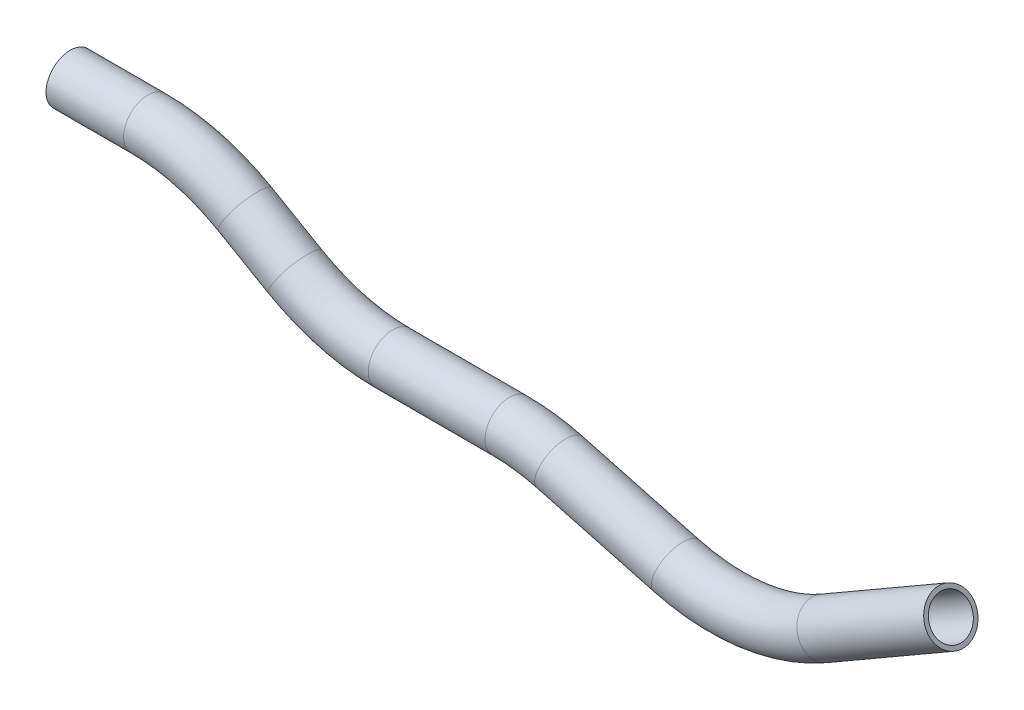
ISO-10303-21;
HEADER;
FILE_DESCRIPTION(('STEP AP214'),'2;1');
FILE_NAME('part.step','',(''),(''),'','','');
FILE_SCHEMA(('AUTOMOTIVE_DESIGN { 1 0 10303 214 1 1 1 1 }'));
ENDSEC;
DATA;
#1=APPLICATION_CONTEXT('core data for automotive mechanical design processes');
#2=APPLICATION_PROTOCOL_DEFINITION('international standard','automotive_design',2000,#1);
#3=PRODUCT_CONTEXT('',#1,'mechanical');
#4=PRODUCT('Part','Part','',(#3));
#5=PRODUCT_RELATED_PRODUCT_CATEGORY('part','',(#4));
#6=PRODUCT_DEFINITION_FORMATION('','',#4);
#7=PRODUCT_DEFINITION_CONTEXT('part definition',#1,'design');
#8=PRODUCT_DEFINITION('design','',#6,#7);
#9=PRODUCT_DEFINITION_SHAPE('','',#8);
#10=(LENGTH_UNIT() NAMED_UNIT(*) SI_UNIT(.MILLI.,.METRE.));
#11=(NAMED_UNIT(*) PLANE_ANGLE_UNIT() SI_UNIT($,.RADIAN.));
#12=(NAMED_UNIT(*) SI_UNIT($,.STERADIAN.) SOLID_ANGLE_UNIT());
#13=UNCERTAINTY_MEASURE_WITH_UNIT(LENGTH_MEASURE(1.E-05),#10,'distance_accuracy_value','');
#14=(GEOMETRIC_REPRESENTATION_CONTEXT(3) GLOBAL_UNCERTAINTY_ASSIGNED_CONTEXT((#13)) GLOBAL_UNIT_ASSIGNED_CONTEXT((#10,
#11,#12)) REPRESENTATION_CONTEXT('',''));
#15=CARTESIAN_POINT('',(0.,0.,0.));
#16=DIRECTION('',(0.,0.,1.));
#17=DIRECTION('',(1.,0.,0.));
#18=AXIS2_PLACEMENT_3D('',#15,#16,#17);
#19=CARTESIAN_POINT('',(-53.3146424442584,60.8356250725051,0.));
#20=DIRECTION('',(1.,0.,0.));
#21=DIRECTION('',(0.,1.,0.));
#22=AXIS2_PLACEMENT_3D('',#19,#20,#21);
#23=CYLINDRICAL_SURFACE('',#22,9.525);
#24=CARTESIAN_POINT('',(-22.93237090751,60.8356250725051,0.));
#25=DIRECTION('',(1.,0.,0.));
#26=DIRECTION('',(0.,1.,0.));
#27=AXIS2_PLACEMENT_3D('',#24,#25,#26);
#28=CIRCLE('',#27,9.525);
#29=CARTESIAN_POINT('',(-22.93237090751,70.3606250725051,0.));
#30=VERTEX_POINT('',#29);
#31=EDGE_CURVE('E58',#30,#30,#28,.T.);
#32=ORIENTED_EDGE('',*,*,#31,.F.);
#33=EDGE_LOOP('',(#32));
#34=FACE_BOUND('',#33,.T.);
#35=CARTESIAN_POINT('',(-53.3146424442584,60.8356250725051,0.));
#36=DIRECTION('',(1.,0.,0.));
#37=DIRECTION('',(0.,1.,0.));
#38=AXIS2_PLACEMENT_3D('',#35,#36,#37);
#39=CIRCLE('',#38,9.525);
#40=CARTESIAN_POINT('',(-53.3146424442584,70.3606250725051,0.));
#41=VERTEX_POINT('',#40);
#42=EDGE_CURVE('E55',#41,#41,#39,.T.);
#43=ORIENTED_EDGE('',*,*,#42,.T.);
#44=EDGE_LOOP('',(#43));
#45=FACE_BOUND('',#44,.T.);
#46=ADVANCED_FACE('F34',(#34,#45),#23,.T.);
#47=CARTESIAN_POINT('',(-22.93237090751,-15.3643749274949,0.));
#48=DIRECTION('',(0.,0.,-1.));
#49=DIRECTION('',(-1.,0.,0.));
#50=AXIS2_PLACEMENT_3D('',#47,#48,#49);
#51=TOROIDAL_SURFACE('',#50,76.2,9.525);
#52=CARTESIAN_POINT('',(15.1676290924901,50.6267608408792,0.));
#53=DIRECTION('',(0.866025403784438,-0.500000000000001,0.));
#54=DIRECTION('',(0.500000000000001,0.866025403784438,0.));
#55=AXIS2_PLACEMENT_3D('',#52,#53,#54);
#56=CIRCLE('',#55,9.525);
#57=CARTESIAN_POINT('',(19.9301290924901,58.8756528119261,0.));
#58=VERTEX_POINT('',#57);
#59=EDGE_CURVE('E61',#58,#58,#56,.T.);
#60=CARTESIAN_POINT('',(-22.93237090751,-15.3643749274949,0.));
#61=DIRECTION('',(0.,0.,-1.));
#62=DIRECTION('',(-1.,0.,0.));
#63=AXIS2_PLACEMENT_3D('',#60,#61,#62);
#64=CIRCLE('',#63,85.725);
#65=EDGE_CURVE('',#30,#58,#64,.T.);
#66=ORIENTED_EDGE('',*,*,#31,.T.);
#67=ORIENTED_EDGE('',*,*,#59,.F.);
#68=ORIENTED_EDGE('',*,*,#65,.T.);
#69=ORIENTED_EDGE('',*,*,#65,.F.);
#70=EDGE_LOOP('',(#66,#68,#67,#69));
#71=FACE_BOUND('',#70,.T.);
#72=ADVANCED_FACE('F118',(#71),#51,.T.);
#73=CARTESIAN_POINT('',(15.1676290924901,50.6267608408793,0.));
#74=DIRECTION('',(0.866025403784438,-0.5,0.));
#75=DIRECTION('',(0.5,0.866025403784438,0.));
#76=AXIS2_PLACEMENT_3D('',#73,#74,#75);
#77=CYLINDRICAL_SURFACE('',#76,9.525);
#78=CARTESIAN_POINT('',(34.7956991593049,39.2944893041309,0.));
#79=DIRECTION('',(0.866025403784439,-0.5,0.));
#80=DIRECTION('',(0.5,0.866025403784439,0.));
#81=AXIS2_PLACEMENT_3D('',#78,#79,#80);
#82=CIRCLE('',#81,9.525);
#83=CARTESIAN_POINT('',(30.0331991593048,31.0455973330841,0.));
#84=VERTEX_POINT('',#83);
#85=EDGE_CURVE('E64',#84,#84,#82,.T.);
#86=ORIENTED_EDGE('',*,*,#85,.F.);
#87=EDGE_LOOP('',(#86));
#88=FACE_BOUND('',#87,.T.);
#89=ORIENTED_EDGE('',*,*,#59,.T.);
#90=EDGE_LOOP('',(#89));
#91=FACE_BOUND('',#90,.T.);
#92=ADVANCED_FACE('F122',(#88,#91),#77,.T.);
#93=CARTESIAN_POINT('',(72.8956991593049,105.285625072505,0.));
#94=DIRECTION('',(0.,0.,1.));
#95=DIRECTION('',(1.,0.,0.));
#96=AXIS2_PLACEMENT_3D('',#93,#94,#95);
#97=TOROIDAL_SURFACE('',#96,76.2,9.525);
#98=CARTESIAN_POINT('',(72.8956991593051,29.0856250725052,0.));
#99=DIRECTION('',(1.,0.,0.));
#100=DIRECTION('',(0.,1.,0.));
#101=AXIS2_PLACEMENT_3D('',#98,#99,#100);
#102=CIRCLE('',#101,9.525);
#103=CARTESIAN_POINT('',(72.8956991593051,19.5606250725051,0.));
#104=VERTEX_POINT('',#103);
#105=EDGE_CURVE('E67',#104,#104,#102,.T.);
#106=CARTESIAN_POINT('',(72.8956991593049,105.285625072505,0.));
#107=DIRECTION('',(0.,0.,1.));
#108=DIRECTION('',(1.,0.,0.));
#109=AXIS2_PLACEMENT_3D('',#106,#107,#108);
#110=CIRCLE('',#109,85.725);
#111=EDGE_CURVE('',#84,#104,#110,.T.);
#112=ORIENTED_EDGE('',*,*,#85,.T.);
#113=ORIENTED_EDGE('',*,*,#105,.F.);
#114=ORIENTED_EDGE('',*,*,#111,.T.);
#115=ORIENTED_EDGE('',*,*,#111,.F.);
#116=EDGE_LOOP('',(#112,#114,#113,#115));
#117=FACE_BOUND('',#116,.T.);
#118=ADVANCED_FACE('F126',(#117),#97,.T.);
#119=CARTESIAN_POINT('',(72.8956991593051,29.0856250725052,0.));
#120=DIRECTION('',(1.,0.,0.));
#121=DIRECTION('',(0.,1.,0.));
#122=AXIS2_PLACEMENT_3D('',#119,#120,#121);
#123=CYLINDRICAL_SURFACE('',#122,9.525);
#124=CARTESIAN_POINT('',(118.646050379894,29.0856250725052,0.));
#125=DIRECTION('',(1.,0.,0.));
#126=DIRECTION('',(0.,1.,0.));
#127=AXIS2_PLACEMENT_3D('',#124,#125,#126);
#128=CIRCLE('',#127,9.525);
#129=CARTESIAN_POINT('',(118.646050379894,38.6106250725052,0.));
#130=VERTEX_POINT('',#129);
#131=EDGE_CURVE('E70',#130,#130,#128,.T.);
#132=ORIENTED_EDGE('',*,*,#131,.F.);
#133=EDGE_LOOP('',(#132));
#134=FACE_BOUND('',#133,.T.);
#135=ORIENTED_EDGE('',*,*,#105,.T.);
#136=EDGE_LOOP('',(#135));
#137=FACE_BOUND('',#136,.T.);
#138=ADVANCED_FACE('F130',(#134,#137),#123,.T.);
#139=CARTESIAN_POINT('',(118.646050379894,-47.1143749274949,0.));
#140=DIRECTION('',(0.,0.,-1.));
#141=DIRECTION('',(-1.,0.,0.));
#142=AXIS2_PLACEMENT_3D('',#139,#140,#141);
#143=TOROIDAL_SURFACE('',#142,76.2000000000001,9.525);
#144=CARTESIAN_POINT('',(138.368061616706,26.4891730357321,0.));
#145=DIRECTION('',(0.965925826289069,-0.25881904510252,0.));
#146=DIRECTION('',(0.25881904510252,0.965925826289069,0.));
#147=AXIS2_PLACEMENT_3D('',#144,#145,#146);
#148=CIRCLE('',#147,9.525);
#149=CARTESIAN_POINT('',(140.833313021308,35.6896165311356,0.));
#150=VERTEX_POINT('',#149);
#151=EDGE_CURVE('E73',#150,#150,#148,.T.);
#152=CARTESIAN_POINT('',(118.646050379894,-47.1143749274949,0.));
#153=DIRECTION('',(0.,0.,-1.));
#154=DIRECTION('',(-1.,0.,0.));
#155=AXIS2_PLACEMENT_3D('',#152,#153,#154);
#156=CIRCLE('',#155,85.7250000000001);
#157=EDGE_CURVE('',#130,#150,#156,.T.);
#158=ORIENTED_EDGE('',*,*,#131,.T.);
#159=ORIENTED_EDGE('',*,*,#151,.F.);
#160=ORIENTED_EDGE('',*,*,#157,.T.);
#161=ORIENTED_EDGE('',*,*,#157,.F.);
#162=EDGE_LOOP('',(#158,#160,#159,#161));
#163=FACE_BOUND('',#162,.T.);
#164=ADVANCED_FACE('F92',(#163),#143,.T.);
#165=CARTESIAN_POINT('',(138.368061616706,26.4891730357321,0.));
#166=DIRECTION('',(0.965925826289068,-0.258819045102521,0.));
#167=DIRECTION('',(0.258819045102521,0.965925826289068,0.));
#168=AXIS2_PLACEMENT_3D('',#165,#166,#167);
#169=CYLINDRICAL_SURFACE('',#168,9.525);
#170=CARTESIAN_POINT('',(184.061188848004,14.2457364944532,0.));
#171=DIRECTION('',(0.965925826289068,-0.258819045102521,0.));
#172=DIRECTION('',(0.258819045102521,0.965925826289068,0.));
#173=AXIS2_PLACEMENT_3D('',#170,#171,#172);
#174=CIRCLE('',#173,9.525);
#175=CARTESIAN_POINT('',(181.595937443403,5.04529299904981,0.));
#176=VERTEX_POINT('',#175);
#177=EDGE_CURVE('E75',#176,#176,#174,.T.);
#178=ORIENTED_EDGE('',*,*,#177,.F.);
#179=EDGE_LOOP('',(#178));
#180=FACE_BOUND('',#179,.T.);
#181=ORIENTED_EDGE('',*,*,#151,.T.);
#182=EDGE_LOOP('',(#181));
#183=FACE_BOUND('',#182,.T.);
#184=ADVANCED_FACE('F85',(#180,#183),#169,.T.);
#185=CARTESIAN_POINT('',(203.783200084816,87.8492844576802,0.));
#186=DIRECTION('',(0.,0.,1.));
#187=DIRECTION('',(1.,0.,0.));
#188=AXIS2_PLACEMENT_3D('',#185,#186,#187);
#189=TOROIDAL_SURFACE('',#188,76.2,9.525);
#190=CARTESIAN_POINT('',(241.883200084816,21.858148689306,0.));
#191=DIRECTION('',(0.866025403784438,0.500000000000001,0.));
#192=DIRECTION('',(-0.500000000000001,0.866025403784438,0.));
#193=AXIS2_PLACEMENT_3D('',#190,#191,#192);
#194=CIRCLE('',#193,9.525);
#195=CARTESIAN_POINT('',(246.645700084816,13.6092567182592,0.));
#196=VERTEX_POINT('',#195);
#197=EDGE_CURVE('E38',#196,#196,#194,.T.);
#198=CARTESIAN_POINT('',(203.783200084816,87.8492844576802,0.));
#199=DIRECTION('',(0.,0.,1.));
#200=DIRECTION('',(1.,0.,0.));
#201=AXIS2_PLACEMENT_3D('',#198,#199,#200);
#202=CIRCLE('',#201,85.725);
#203=EDGE_CURVE('',#176,#196,#202,.T.);
#204=ORIENTED_EDGE('',*,*,#177,.T.);
#205=ORIENTED_EDGE('',*,*,#197,.F.);
#206=ORIENTED_EDGE('',*,*,#203,.T.);
#207=ORIENTED_EDGE('',*,*,#203,.F.);
#208=EDGE_LOOP('',(#204,#206,#205,#207));
#209=FACE_BOUND('',#208,.T.);
#210=ADVANCED_FACE('F83',(#209),#189,.T.);
#211=CARTESIAN_POINT('',(241.883200084817,21.858148689306,0.));
#212=DIRECTION('',(0.866025403784437,0.500000000000003,0.));
#213=DIRECTION('',(-0.500000000000003,0.866025403784437,0.));
#214=AXIS2_PLACEMENT_3D('',#211,#212,#213);
#215=CYLINDRICAL_SURFACE('',#214,9.525);
#216=CARTESIAN_POINT('',(291.538435049588,50.5266119628912,0.));
#217=DIRECTION('',(0.866025403784437,0.500000000000003,0.));
#218=DIRECTION('',(-0.500000000000003,0.866025403784437,0.));
#219=AXIS2_PLACEMENT_3D('',#216,#217,#218);
#220=CIRCLE('',#219,9.525);
#221=CARTESIAN_POINT('',(286.775935049588,58.775503933938,0.));
#222=VERTEX_POINT('',#221);
#223=EDGE_CURVE('E51',#222,#222,#220,.T.);
#224=ORIENTED_EDGE('',*,*,#223,.F.);
#225=EDGE_LOOP('',(#224));
#226=FACE_BOUND('',#225,.T.);
#227=ORIENTED_EDGE('',*,*,#197,.T.);
#228=EDGE_LOOP('',(#227));
#229=FACE_BOUND('',#228,.T.);
#230=ADVANCED_FACE('F36',(#226,#229),#215,.T.);
#231=CARTESIAN_POINT('',(-53.3146424442584,60.8356250725051,0.));
#232=DIRECTION('',(1.,0.,0.));
#233=DIRECTION('',(0.,1.,0.));
#234=AXIS2_PLACEMENT_3D('',#231,#232,#233);
#235=PLANE('',#234);
#236=CARTESIAN_POINT('',(-53.3146424442584,60.8356250725051,0.));
#237=DIRECTION('',(1.,0.,0.));
#238=DIRECTION('',(0.,1.,0.));
#239=AXIS2_PLACEMENT_3D('',#236,#237,#238);
#240=CIRCLE('',#239,7.874);
#241=CARTESIAN_POINT('',(-53.3146424442584,68.7096250725051,0.));
#242=VERTEX_POINT('',#241);
#243=EDGE_CURVE('E54',#242,#242,#240,.F.);
#244=ORIENTED_EDGE('',*,*,#243,.F.);
#245=EDGE_LOOP('',(#244));
#246=FACE_BOUND('',#245,.T.);
#247=ORIENTED_EDGE('',*,*,#42,.F.);
#248=EDGE_LOOP('',(#247));
#249=FACE_BOUND('',#248,.T.);
#250=ADVANCED_FACE('F90',(#246,#249),#235,.F.);
#251=CARTESIAN_POINT('',(291.538435049588,50.5266119628912,0.));
#252=DIRECTION('',(0.866025403784437,0.500000000000003,0.));
#253=DIRECTION('',(-0.500000000000003,0.866025403784437,0.));
#254=AXIS2_PLACEMENT_3D('',#251,#252,#253);
#255=PLANE('',#254);
#256=CARTESIAN_POINT('',(291.538435049588,50.5266119628912,0.));
#257=DIRECTION('',(0.866025403784437,0.500000000000003,0.));
#258=DIRECTION('',(-0.500000000000003,0.866025403784437,0.));
#259=AXIS2_PLACEMENT_3D('',#256,#257,#258);
#260=CIRCLE('',#259,7.874);
#261=CARTESIAN_POINT('',(287.601435049588,57.3456959922899,0.));
#262=VERTEX_POINT('',#261);
#263=EDGE_CURVE('E10',#262,#262,#260,.F.);
#264=ORIENTED_EDGE('',*,*,#263,.T.);
#265=EDGE_LOOP('',(#264));
#266=FACE_BOUND('',#265,.T.);
#267=ORIENTED_EDGE('',*,*,#223,.T.);
#268=EDGE_LOOP('',(#267));
#269=FACE_BOUND('',#268,.T.);
#270=ADVANCED_FACE('F109',(#266,#269),#255,.T.);
#271=CARTESIAN_POINT('',(-53.3146424442584,60.8356250725051,0.));
#272=DIRECTION('',(1.,0.,0.));
#273=DIRECTION('',(0.,1.,0.));
#274=AXIS2_PLACEMENT_3D('',#271,#272,#273);
#275=CYLINDRICAL_SURFACE('',#274,7.874);
#276=CARTESIAN_POINT('',(-22.93237090751,60.8356250725051,0.));
#277=DIRECTION('',(1.,0.,0.));
#278=DIRECTION('',(0.,1.,0.));
#279=AXIS2_PLACEMENT_3D('',#276,#277,#278);
#280=CIRCLE('',#279,7.874);
#281=CARTESIAN_POINT('',(-22.93237090751,68.7096250725051,0.));
#282=VERTEX_POINT('',#281);
#283=EDGE_CURVE('E283',#282,#282,#280,.F.);
#284=ORIENTED_EDGE('',*,*,#283,.F.);
#285=EDGE_LOOP('',(#284));
#286=FACE_BOUND('',#285,.T.);
#287=ORIENTED_EDGE('',*,*,#243,.T.);
#288=EDGE_LOOP('',(#287));
#289=FACE_BOUND('',#288,.T.);
#290=ADVANCED_FACE('F112',(#286,#289),#275,.F.);
#291=CARTESIAN_POINT('',(-22.93237090751,-15.3643749274949,0.));
#292=DIRECTION('',(0.,0.,-1.));
#293=DIRECTION('',(-1.,0.,0.));
#294=AXIS2_PLACEMENT_3D('',#291,#292,#293);
#295=TOROIDAL_SURFACE('',#294,76.2,7.874);
#296=CARTESIAN_POINT('',(15.1676290924901,50.6267608408792,0.));
#297=DIRECTION('',(0.866025403784438,-0.500000000000001,0.));
#298=DIRECTION('',(0.500000000000001,0.866025403784438,0.));
#299=AXIS2_PLACEMENT_3D('',#296,#297,#298);
#300=CIRCLE('',#299,7.874);
#301=CARTESIAN_POINT('',(19.1046290924901,57.4458448702779,0.));
#302=VERTEX_POINT('',#301);
#303=EDGE_CURVE('E280',#302,#302,#300,.F.);
#304=CARTESIAN_POINT('',(-22.93237090751,-15.3643749274949,0.));
#305=DIRECTION('',(0.,0.,-1.));
#306=DIRECTION('',(-1.,0.,0.));
#307=AXIS2_PLACEMENT_3D('',#304,#305,#306);
#308=CIRCLE('',#307,84.074);
#309=EDGE_CURVE('',#282,#302,#308,.T.);
#310=ORIENTED_EDGE('',*,*,#283,.T.);
#311=ORIENTED_EDGE('',*,*,#303,.F.);
#312=ORIENTED_EDGE('',*,*,#309,.T.);
#313=ORIENTED_EDGE('',*,*,#309,.F.);
#314=EDGE_LOOP('',(#310,#312,#311,#313));
#315=FACE_BOUND('',#314,.T.);
#316=ADVANCED_FACE('F191',(#315),#295,.F.);
#317=CARTESIAN_POINT('',(15.1676290924901,50.6267608408793,0.));
#318=DIRECTION('',(0.866025403784438,-0.5,0.));
#319=DIRECTION('',(0.5,0.866025403784438,0.));
#320=AXIS2_PLACEMENT_3D('',#317,#318,#319);
#321=CYLINDRICAL_SURFACE('',#320,7.874);
#322=CARTESIAN_POINT('',(34.7956991593049,39.2944893041309,0.));
#323=DIRECTION('',(0.866025403784439,-0.5,0.));
#324=DIRECTION('',(0.5,0.866025403784439,0.));
#325=AXIS2_PLACEMENT_3D('',#322,#323,#324);
#326=CIRCLE('',#325,7.874);
#327=CARTESIAN_POINT('',(30.8586991593048,32.4754052747322,0.));
#328=VERTEX_POINT('',#327);
#329=EDGE_CURVE('E277',#328,#328,#326,.F.);
#330=ORIENTED_EDGE('',*,*,#329,.F.);
#331=EDGE_LOOP('',(#330));
#332=FACE_BOUND('',#331,.T.);
#333=ORIENTED_EDGE('',*,*,#303,.T.);
#334=EDGE_LOOP('',(#333));
#335=FACE_BOUND('',#334,.T.);
#336=ADVANCED_FACE('F201',(#332,#335),#321,.F.);
#337=CARTESIAN_POINT('',(72.8956991593049,105.285625072505,0.));
#338=DIRECTION('',(0.,0.,1.));
#339=DIRECTION('',(1.,0.,0.));
#340=AXIS2_PLACEMENT_3D('',#337,#338,#339);
#341=TOROIDAL_SURFACE('',#340,76.2,7.874);
#342=CARTESIAN_POINT('',(72.8956991593051,29.0856250725052,0.));
#343=DIRECTION('',(1.,0.,0.));
#344=DIRECTION('',(0.,1.,0.));
#345=AXIS2_PLACEMENT_3D('',#342,#343,#344);
#346=CIRCLE('',#345,7.874);
#347=CARTESIAN_POINT('',(72.8956991593051,21.2116250725051,0.));
#348=VERTEX_POINT('',#347);
#349=EDGE_CURVE('E272',#348,#348,#346,.F.);
#350=CARTESIAN_POINT('',(72.8956991593049,105.285625072505,0.));
#351=DIRECTION('',(0.,0.,1.));
#352=DIRECTION('',(1.,0.,0.));
#353=AXIS2_PLACEMENT_3D('',#350,#351,#352);
#354=CIRCLE('',#353,84.074);
#355=EDGE_CURVE('',#328,#348,#354,.T.);
#356=ORIENTED_EDGE('',*,*,#329,.T.);
#357=ORIENTED_EDGE('',*,*,#349,.F.);
#358=ORIENTED_EDGE('',*,*,#355,.T.);
#359=ORIENTED_EDGE('',*,*,#355,.F.);
#360=EDGE_LOOP('',(#356,#358,#357,#359));
#361=FACE_BOUND('',#360,.T.);
#362=ADVANCED_FACE('F211',(#361),#341,.F.);
#363=CARTESIAN_POINT('',(72.8956991593051,29.0856250725052,0.));
#364=DIRECTION('',(1.,0.,0.));
#365=DIRECTION('',(0.,1.,0.));
#366=AXIS2_PLACEMENT_3D('',#363,#364,#365);
#367=CYLINDRICAL_SURFACE('',#366,7.874);
#368=CARTESIAN_POINT('',(118.646050379894,29.0856250725052,0.));
#369=DIRECTION('',(1.,0.,0.));
#370=DIRECTION('',(0.,1.,0.));
#371=AXIS2_PLACEMENT_3D('',#368,#369,#370);
#372=CIRCLE('',#371,7.874);
#373=CARTESIAN_POINT('',(118.646050379894,36.9596250725052,0.));
#374=VERTEX_POINT('',#373);
#375=EDGE_CURVE('E269',#374,#374,#372,.F.);
#376=ORIENTED_EDGE('',*,*,#375,.F.);
#377=EDGE_LOOP('',(#376));
#378=FACE_BOUND('',#377,.T.);
#379=ORIENTED_EDGE('',*,*,#349,.T.);
#380=EDGE_LOOP('',(#379));
#381=FACE_BOUND('',#380,.T.);
#382=ADVANCED_FACE('F221',(#378,#381),#367,.F.);
#383=CARTESIAN_POINT('',(118.646050379894,-47.1143749274949,0.));
#384=DIRECTION('',(0.,0.,-1.));
#385=DIRECTION('',(-1.,0.,0.));
#386=AXIS2_PLACEMENT_3D('',#383,#384,#385);
#387=TOROIDAL_SURFACE('',#386,76.2000000000001,7.874);
#388=CARTESIAN_POINT('',(138.368061616706,26.4891730357321,0.));
#389=DIRECTION('',(0.965925826289069,-0.25881904510252,0.));
#390=DIRECTION('',(0.25881904510252,0.965925826289069,0.));
#391=AXIS2_PLACEMENT_3D('',#388,#389,#390);
#392=CIRCLE('',#391,7.874);
#393=CARTESIAN_POINT('',(140.406002777843,34.0948729919323,0.));
#394=VERTEX_POINT('',#393);
#395=EDGE_CURVE('E268',#394,#394,#392,.F.);
#396=CARTESIAN_POINT('',(118.646050379894,-47.1143749274949,0.));
#397=DIRECTION('',(0.,0.,-1.));
#398=DIRECTION('',(-1.,0.,0.));
#399=AXIS2_PLACEMENT_3D('',#396,#397,#398);
#400=CIRCLE('',#399,84.0740000000001);
#401=EDGE_CURVE('',#374,#394,#400,.T.);
#402=ORIENTED_EDGE('',*,*,#375,.T.);
#403=ORIENTED_EDGE('',*,*,#395,.F.);
#404=ORIENTED_EDGE('',*,*,#401,.T.);
#405=ORIENTED_EDGE('',*,*,#401,.F.);
#406=EDGE_LOOP('',(#402,#404,#403,#405));
#407=FACE_BOUND('',#406,.T.);
#408=ADVANCED_FACE('F231',(#407),#387,.F.);
#409=CARTESIAN_POINT('',(138.368061616706,26.4891730357321,0.));
#410=DIRECTION('',(0.965925826289068,-0.258819045102521,0.));
#411=DIRECTION('',(0.258819045102521,0.965925826289068,0.));
#412=AXIS2_PLACEMENT_3D('',#409,#410,#411);
#413=CYLINDRICAL_SURFACE('',#412,7.874);
#414=CARTESIAN_POINT('',(184.061188848004,14.2457364944532,0.));
#415=DIRECTION('',(0.965925826289068,-0.258819045102521,0.));
#416=DIRECTION('',(0.258819045102521,0.965925826289068,0.));
#417=AXIS2_PLACEMENT_3D('',#414,#415,#416);
#418=CIRCLE('',#417,7.874);
#419=CARTESIAN_POINT('',(182.023247686867,6.64003653825305,0.));
#420=VERTEX_POINT('',#419);
#421=EDGE_CURVE('E47',#420,#420,#418,.F.);
#422=ORIENTED_EDGE('',*,*,#421,.F.);
#423=EDGE_LOOP('',(#422));
#424=FACE_BOUND('',#423,.T.);
#425=ORIENTED_EDGE('',*,*,#395,.T.);
#426=EDGE_LOOP('',(#425));
#427=FACE_BOUND('',#426,.T.);
#428=ADVANCED_FACE('F103',(#424,#427),#413,.F.);
#429=CARTESIAN_POINT('',(203.783200084816,87.8492844576802,0.));
#430=DIRECTION('',(0.,0.,1.));
#431=DIRECTION('',(1.,0.,0.));
#432=AXIS2_PLACEMENT_3D('',#429,#430,#431);
#433=TOROIDAL_SURFACE('',#432,76.2,7.874);
#434=CARTESIAN_POINT('',(241.883200084816,21.858148689306,0.));
#435=DIRECTION('',(0.866025403784438,0.500000000000001,0.));
#436=DIRECTION('',(-0.500000000000001,0.866025403784438,0.));
#437=AXIS2_PLACEMENT_3D('',#434,#435,#436);
#438=CIRCLE('',#437,7.874);
#439=CARTESIAN_POINT('',(245.820200084816,15.0390646599073,0.));
#440=VERTEX_POINT('',#439);
#441=EDGE_CURVE('E42',#440,#440,#438,.F.);
#442=CARTESIAN_POINT('',(203.783200084816,87.8492844576802,0.));
#443=DIRECTION('',(0.,0.,1.));
#444=DIRECTION('',(1.,0.,0.));
#445=AXIS2_PLACEMENT_3D('',#442,#443,#444);
#446=CIRCLE('',#445,84.074);
#447=EDGE_CURVE('',#420,#440,#446,.T.);
#448=ORIENTED_EDGE('',*,*,#421,.T.);
#449=ORIENTED_EDGE('',*,*,#441,.F.);
#450=ORIENTED_EDGE('',*,*,#447,.T.);
#451=ORIENTED_EDGE('',*,*,#447,.F.);
#452=EDGE_LOOP('',(#448,#450,#449,#451));
#453=FACE_BOUND('',#452,.T.);
#454=ADVANCED_FACE('F97',(#453),#433,.F.);
#455=CARTESIAN_POINT('',(241.883200084817,21.858148689306,0.));
#456=DIRECTION('',(0.866025403784437,0.500000000000003,0.));
#457=DIRECTION('',(-0.500000000000003,0.866025403784437,0.));
#458=AXIS2_PLACEMENT_3D('',#455,#456,#457);
#459=CYLINDRICAL_SURFACE('',#458,7.874);
#460=ORIENTED_EDGE('',*,*,#263,.F.);
#461=EDGE_LOOP('',(#460));
#462=FACE_BOUND('',#461,.T.);
#463=ORIENTED_EDGE('',*,*,#441,.T.);
#464=EDGE_LOOP('',(#463));
#465=FACE_BOUND('',#464,.T.);
#466=ADVANCED_FACE('F95',(#462,#465),#459,.F.);
#467=CLOSED_SHELL('',(#46,#72,#92,#118,#138,#164,#184,#210,#230,#250,#270,#290,#316,#336,#362,
#382,#408,#428,#454,#466));
#468=MANIFOLD_SOLID_BREP('B2',#467);
#469=ADVANCED_BREP_SHAPE_REPRESENTATION('',(#18,#468),#14);
#470=SHAPE_DEFINITION_REPRESENTATION(#9,#469);
ENDSEC;
END-ISO-10303-21;
